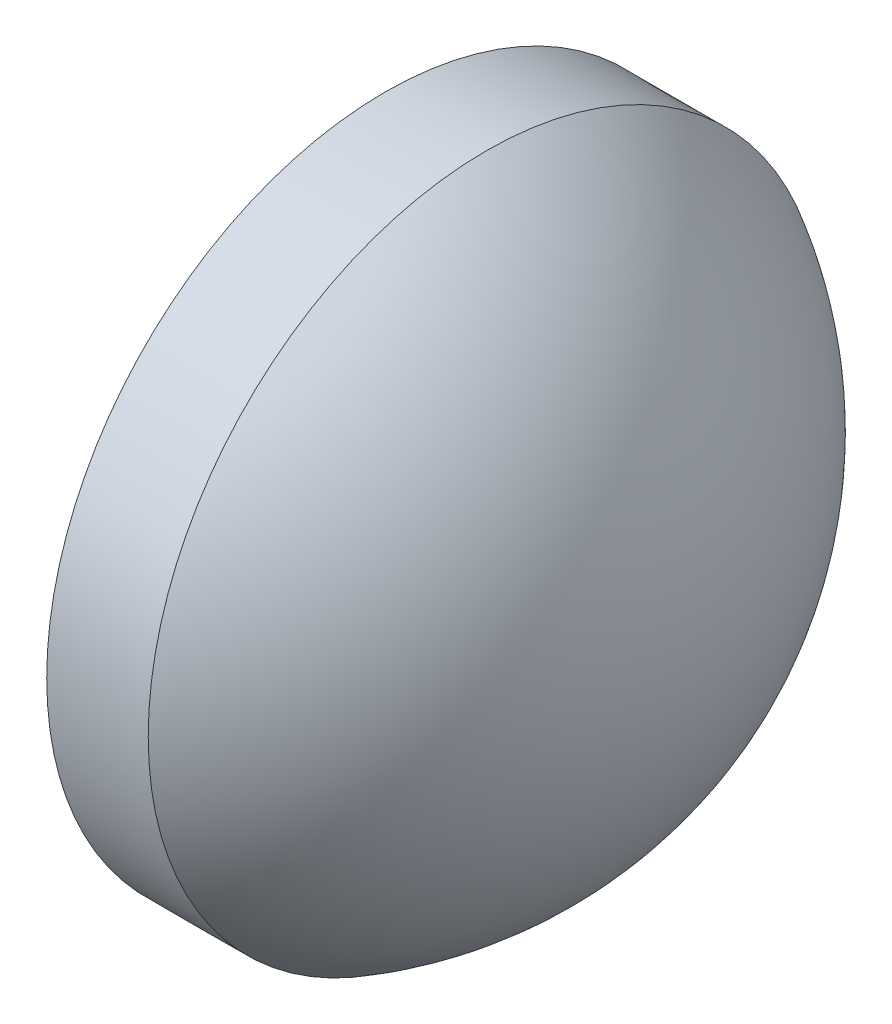
ISO-10303-21;
HEADER;
FILE_DESCRIPTION(('STEP AP214'),'2;1');
FILE_NAME('part.step','',(''),(''),'','','');
FILE_SCHEMA(('AUTOMOTIVE_DESIGN { 1 0 10303 214 1 1 1 1 }'));
ENDSEC;
DATA;
#1=APPLICATION_CONTEXT('core data for automotive mechanical design processes');
#2=APPLICATION_PROTOCOL_DEFINITION('international standard','automotive_design',2000,#1);
#3=PRODUCT_CONTEXT('',#1,'mechanical');
#4=PRODUCT('Part','Part','',(#3));
#5=PRODUCT_RELATED_PRODUCT_CATEGORY('part','',(#4));
#6=PRODUCT_DEFINITION_FORMATION('','',#4);
#7=PRODUCT_DEFINITION_CONTEXT('part definition',#1,'design');
#8=PRODUCT_DEFINITION('design','',#6,#7);
#9=PRODUCT_DEFINITION_SHAPE('','',#8);
#10=(LENGTH_UNIT() NAMED_UNIT(*) SI_UNIT(.MILLI.,.METRE.));
#11=(NAMED_UNIT(*) PLANE_ANGLE_UNIT() SI_UNIT($,.RADIAN.));
#12=(NAMED_UNIT(*) SI_UNIT($,.STERADIAN.) SOLID_ANGLE_UNIT());
#13=UNCERTAINTY_MEASURE_WITH_UNIT(LENGTH_MEASURE(1.E-05),#10,'distance_accuracy_value','');
#14=(GEOMETRIC_REPRESENTATION_CONTEXT(3) GLOBAL_UNCERTAINTY_ASSIGNED_CONTEXT((#13)) GLOBAL_UNIT_ASSIGNED_CONTEXT((#10,
#11,#12)) REPRESENTATION_CONTEXT('',''));
#15=CARTESIAN_POINT('',(0.,0.,0.));
#16=DIRECTION('',(0.,0.,1.));
#17=DIRECTION('',(1.,0.,0.));
#18=AXIS2_PLACEMENT_3D('',#15,#16,#17);
#19=CARTESIAN_POINT('',(21.4661664109882,13.0645394012325,0.));
#20=DIRECTION('',(0.,0.,-1.));
#21=DIRECTION('',(0.000119442569841144,-0.999999992866736,0.));
#22=AXIS2_PLACEMENT_3D('',#19,#20,#21);
#23=CIRCLE('',#22,5.73121160409556);
#24=TRIMMED_CURVE('',#23,(PARAMETER_VALUE(-1.57082344498014)),
(PARAMETER_VALUE(1.57082344498014)),.T.,.PARAMETER.);
#25=CARTESIAN_POINT('',(21.4661663924244,13.0646948212893,0.));
#26=DIRECTION('',(-0.999999992866736,-0.000119442569841144,0.));
#27=AXIS1_PLACEMENT('',#25,#26);
#28=SURFACE_OF_REVOLUTION('',#24,#27);
#29=CARTESIAN_POINT('',(24.2679751694014,13.0650294765322,0.));
#30=DIRECTION('',(-0.999999992866736,-0.000119442569841144,0.));
#31=DIRECTION('',(0.000119442569841144,-0.999999992866736,0.));
#32=AXIS2_PLACEMENT_3D('',#29,#30,#31);
#33=CIRCLE('',#32,4.99982080047892);
#34=CARTESIAN_POINT('',(24.2685723608465,8.06520871171833,0.));
#35=VERTEX_POINT('',#34);
#36=EDGE_CURVE('E11',#35,#35,#33,.T.);
#37=ORIENTED_EDGE('',*,*,#36,.F.);
#38=EDGE_LOOP('',(#37));
#39=FACE_BOUND('',#38,.T.);
#40=CARTESIAN_POINT('',(27.1973779535304,13.0653793719313,0.));
#41=VERTEX_POINT('',#40);
#42=VERTEX_LOOP('',#41);
#43=FACE_BOUND('',#42,.T.);
#44=ADVANCED_FACE('F37',(#39,#43),#28,.T.);
#45=CARTESIAN_POINT('',(24.2679751694014,13.0650294765322,0.));
#46=DIRECTION('',(-0.999999992866736,-0.000119442569841144,0.));
#47=DIRECTION('',(0.000119442569841144,-0.999999992866736,0.));
#48=AXIS2_PLACEMENT_3D('',#45,#46,#47);
#49=CONICAL_SURFACE('',#48,4.99982080047892,0.000119442570125704);
#50=CARTESIAN_POINT('',(22.7679751908012,13.0648503126787,0.));
#51=DIRECTION('',(-0.999999992866736,-0.000119442569841144,0.));
#52=DIRECTION('',(0.000119442569841144,-0.999999992866736,0.));
#53=AXIS2_PLACEMENT_3D('',#50,#51,#52);
#54=CIRCLE('',#53,4.99999996433368);
#55=CARTESIAN_POINT('',(22.7685724036461,8.06485038401137,0.));
#56=VERTEX_POINT('',#55);
#57=EDGE_CURVE('E44',#56,#56,#54,.T.);
#58=ORIENTED_EDGE('',*,*,#57,.F.);
#59=EDGE_LOOP('',(#58));
#60=FACE_BOUND('',#59,.T.);
#61=ORIENTED_EDGE('',*,*,#36,.T.);
#62=EDGE_LOOP('',(#61));
#63=FACE_BOUND('',#62,.T.);
#64=ADVANCED_FACE('F53',(#60,#63),#49,.T.);
#65=CARTESIAN_POINT('',(22.7679751908012,13.0648503126787,0.));
#66=DIRECTION('',(0.999999992866736,0.000119442569841144,0.));
#67=DIRECTION('',(-0.000119442569841144,0.999999992866736,0.));
#68=AXIS2_PLACEMENT_3D('',#65,#66,#67);
#69=CONICAL_SURFACE('',#68,4.99999996433369,1.57067688422477);
#70=CARTESIAN_POINT('',(22.7673779779562,13.0648502413461,0.));
#71=VERTEX_POINT('',#70);
#72=VERTEX_LOOP('',#71);
#73=FACE_BOUND('',#72,.T.);
#74=ORIENTED_EDGE('',*,*,#57,.T.);
#75=EDGE_LOOP('',(#74));
#76=FACE_BOUND('',#75,.T.);
#77=ADVANCED_FACE('F50',(#73,#76),#69,.T.);
#78=CLOSED_SHELL('',(#44,#64,#77));
#79=MANIFOLD_SOLID_BREP('B2',#78);
#80=ADVANCED_BREP_SHAPE_REPRESENTATION('',(#18,#79),#14);
#81=SHAPE_DEFINITION_REPRESENTATION(#9,#80);
ENDSEC;
END-ISO-10303-21;
